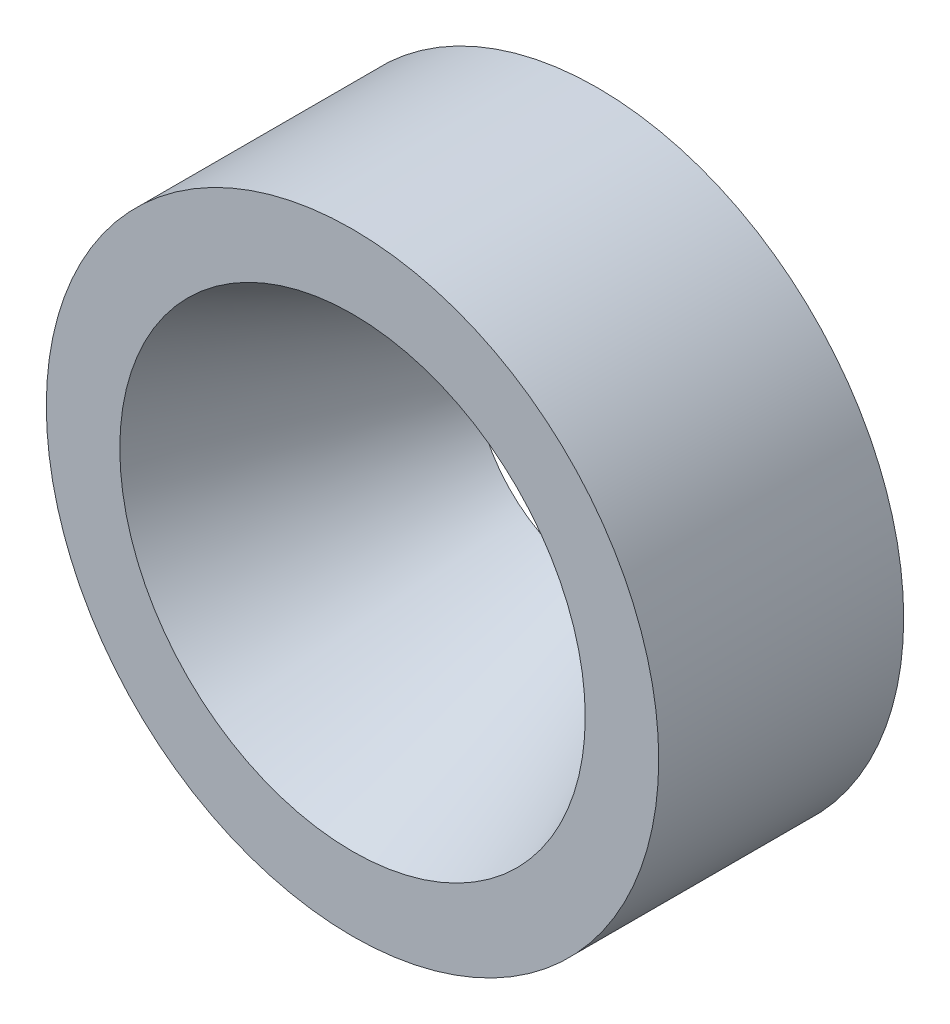
ISO-10303-21;
HEADER;
FILE_DESCRIPTION(('STEP AP214'),'2;1');
FILE_NAME('part.step','',(''),(''),'','','');
FILE_SCHEMA(('AUTOMOTIVE_DESIGN { 1 0 10303 214 1 1 1 1 }'));
ENDSEC;
DATA;
#1=APPLICATION_CONTEXT('core data for automotive mechanical design processes');
#2=APPLICATION_PROTOCOL_DEFINITION('international standard','automotive_design',2000,#1);
#3=PRODUCT_CONTEXT('',#1,'mechanical');
#4=PRODUCT('Part','Part','',(#3));
#5=PRODUCT_RELATED_PRODUCT_CATEGORY('part','',(#4));
#6=PRODUCT_DEFINITION_FORMATION('','',#4);
#7=PRODUCT_DEFINITION_CONTEXT('part definition',#1,'design');
#8=PRODUCT_DEFINITION('design','',#6,#7);
#9=PRODUCT_DEFINITION_SHAPE('','',#8);
#10=(LENGTH_UNIT() NAMED_UNIT(*) SI_UNIT(.MILLI.,.METRE.));
#11=(NAMED_UNIT(*) PLANE_ANGLE_UNIT() SI_UNIT($,.RADIAN.));
#12=(NAMED_UNIT(*) SI_UNIT($,.STERADIAN.) SOLID_ANGLE_UNIT());
#13=UNCERTAINTY_MEASURE_WITH_UNIT(LENGTH_MEASURE(1.E-05),#10,'distance_accuracy_value','');
#14=(GEOMETRIC_REPRESENTATION_CONTEXT(3) GLOBAL_UNCERTAINTY_ASSIGNED_CONTEXT((#13)) GLOBAL_UNIT_ASSIGNED_CONTEXT((#10,
#11,#12)) REPRESENTATION_CONTEXT('',''));
#15=CARTESIAN_POINT('',(0.,0.,0.));
#16=DIRECTION('',(0.,0.,1.));
#17=DIRECTION('',(1.,0.,0.));
#18=AXIS2_PLACEMENT_3D('',#15,#16,#17);
#19=CARTESIAN_POINT('',(0.,-27.5,231.769035606021));
#20=DIRECTION('',(0.,0.,-1.));
#21=DIRECTION('',(-1.,0.,0.));
#22=AXIS2_PLACEMENT_3D('',#19,#20,#21);
#23=PLANE('',#22);
#24=CARTESIAN_POINT('',(0.,-40.,231.769035606021));
#25=DIRECTION('',(0.,0.,1.));
#26=DIRECTION('',(1.,0.,0.));
#27=AXIS2_PLACEMENT_3D('',#24,#25,#26);
#28=CIRCLE('',#27,9.5);
#29=CARTESIAN_POINT('',(9.5,-40.,231.769035606021));
#30=VERTEX_POINT('',#29);
#31=EDGE_CURVE('E10',#30,#30,#28,.T.);
#32=ORIENTED_EDGE('',*,*,#31,.F.);
#33=EDGE_LOOP('',(#32));
#34=FACE_BOUND('',#33,.T.);
#35=CARTESIAN_POINT('',(0.,-40.,231.769035606021));
#36=DIRECTION('',(0.,0.,1.));
#37=DIRECTION('',(1.,0.,0.));
#38=AXIS2_PLACEMENT_3D('',#35,#36,#37);
#39=CIRCLE('',#38,12.5);
#40=CARTESIAN_POINT('',(12.5,-40.,231.769035606021));
#41=VERTEX_POINT('',#40);
#42=EDGE_CURVE('E53',#41,#41,#39,.T.);
#43=ORIENTED_EDGE('',*,*,#42,.T.);
#44=EDGE_LOOP('',(#43));
#45=FACE_BOUND('',#44,.T.);
#46=ADVANCED_FACE('F39',(#34,#45),#23,.F.);
#47=CARTESIAN_POINT('',(0.,-40.,231.769035606021));
#48=DIRECTION('',(0.,0.,1.));
#49=DIRECTION('',(1.,0.,0.));
#50=AXIS2_PLACEMENT_3D('',#47,#48,#49);
#51=CONICAL_SURFACE('',#50,9.5,0.422853926132941);
#52=CARTESIAN_POINT('',(0.,-40.,221.769035606021));
#53=DIRECTION('',(0.,0.,1.));
#54=DIRECTION('',(1.,0.,0.));
#55=AXIS2_PLACEMENT_3D('',#52,#53,#54);
#56=CIRCLE('',#55,5.);
#57=CARTESIAN_POINT('',(5.,-40.,221.769035606021));
#58=VERTEX_POINT('',#57);
#59=EDGE_CURVE('E45',#58,#58,#56,.T.);
#60=ORIENTED_EDGE('',*,*,#59,.F.);
#61=EDGE_LOOP('',(#60));
#62=FACE_BOUND('',#61,.T.);
#63=ORIENTED_EDGE('',*,*,#31,.T.);
#64=EDGE_LOOP('',(#63));
#65=FACE_BOUND('',#64,.T.);
#66=ADVANCED_FACE('F68',(#62,#65),#51,.F.);
#67=CARTESIAN_POINT('',(0.,-27.5,221.769035606021));
#68=DIRECTION('',(0.,0.,1.));
#69=DIRECTION('',(1.,0.,0.));
#70=AXIS2_PLACEMENT_3D('',#67,#68,#69);
#71=PLANE('',#70);
#72=CARTESIAN_POINT('',(0.,-40.,221.769035606021));
#73=DIRECTION('',(0.,0.,1.));
#74=DIRECTION('',(1.,0.,0.));
#75=AXIS2_PLACEMENT_3D('',#72,#73,#74);
#76=CIRCLE('',#75,12.5);
#77=CARTESIAN_POINT('',(12.5,-40.,221.769035606021));
#78=VERTEX_POINT('',#77);
#79=EDGE_CURVE('E49',#78,#78,#76,.T.);
#80=ORIENTED_EDGE('',*,*,#79,.F.);
#81=EDGE_LOOP('',(#80));
#82=FACE_BOUND('',#81,.T.);
#83=ORIENTED_EDGE('',*,*,#59,.T.);
#84=EDGE_LOOP('',(#83));
#85=FACE_BOUND('',#84,.T.);
#86=ADVANCED_FACE('F63',(#82,#85),#71,.F.);
#87=CARTESIAN_POINT('',(0.,-40.,231.769035606021));
#88=DIRECTION('',(0.,0.,1.));
#89=DIRECTION('',(1.,0.,0.));
#90=AXIS2_PLACEMENT_3D('',#87,#88,#89);
#91=CYLINDRICAL_SURFACE('',#90,12.5);
#92=ORIENTED_EDGE('',*,*,#42,.F.);
#93=EDGE_LOOP('',(#92));
#94=FACE_BOUND('',#93,.T.);
#95=ORIENTED_EDGE('',*,*,#79,.T.);
#96=EDGE_LOOP('',(#95));
#97=FACE_BOUND('',#96,.T.);
#98=ADVANCED_FACE('F60',(#94,#97),#91,.T.);
#99=CLOSED_SHELL('',(#46,#66,#86,#98));
#100=MANIFOLD_SOLID_BREP('B2',#99);
#101=ADVANCED_BREP_SHAPE_REPRESENTATION('',(#18,#100),#14);
#102=SHAPE_DEFINITION_REPRESENTATION(#9,#101);
ENDSEC;
END-ISO-10303-21;
